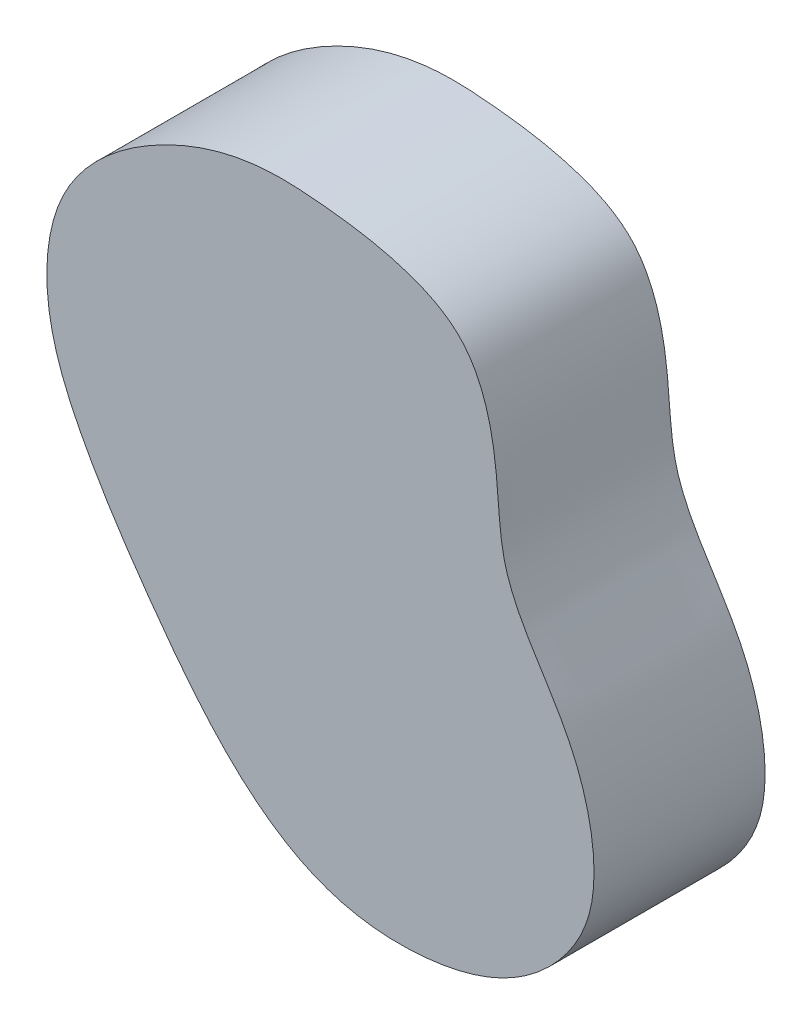
ISO-10303-21;
HEADER;
FILE_DESCRIPTION(('STEP AP214'),'2;1');
FILE_NAME('part.step','',(''),(''),'','','');
FILE_SCHEMA(('AUTOMOTIVE_DESIGN { 1 0 10303 214 1 1 1 1 }'));
ENDSEC;
DATA;
#1=APPLICATION_CONTEXT('core data for automotive mechanical design processes');
#2=APPLICATION_PROTOCOL_DEFINITION('international standard','automotive_design',2000,#1);
#3=PRODUCT_CONTEXT('',#1,'mechanical');
#4=PRODUCT('Part','Part','',(#3));
#5=PRODUCT_RELATED_PRODUCT_CATEGORY('part','',(#4));
#6=PRODUCT_DEFINITION_FORMATION('','',#4);
#7=PRODUCT_DEFINITION_CONTEXT('part definition',#1,'design');
#8=PRODUCT_DEFINITION('design','',#6,#7);
#9=PRODUCT_DEFINITION_SHAPE('','',#8);
#10=(LENGTH_UNIT() NAMED_UNIT(*) SI_UNIT(.MILLI.,.METRE.));
#11=(NAMED_UNIT(*) PLANE_ANGLE_UNIT() SI_UNIT($,.RADIAN.));
#12=(NAMED_UNIT(*) SI_UNIT($,.STERADIAN.) SOLID_ANGLE_UNIT());
#13=UNCERTAINTY_MEASURE_WITH_UNIT(LENGTH_MEASURE(1.E-05),#10,'distance_accuracy_value','');
#14=(GEOMETRIC_REPRESENTATION_CONTEXT(3) GLOBAL_UNCERTAINTY_ASSIGNED_CONTEXT((#13)) GLOBAL_UNIT_ASSIGNED_CONTEXT((#10,
#11,#12)) REPRESENTATION_CONTEXT('',''));
#15=CARTESIAN_POINT('',(0.,0.,0.));
#16=DIRECTION('',(0.,0.,1.));
#17=DIRECTION('',(1.,0.,0.));
#18=AXIS2_PLACEMENT_3D('',#15,#16,#17);
#19=CARTESIAN_POINT('',(14.4126326379732,82.6880855721991,20.));
#20=CARTESIAN_POINT('',(10.6924577953716,82.2592166150717,20.));
#21=CARTESIAN_POINT('',(1.96312079757312,79.3683401060966,20.));
#22=CARTESIAN_POINT('',(-9.52157975276191,69.9092963397695,20.));
#23=CARTESIAN_POINT('',(-10.4578346053765,55.1229649615053,20.));
#24=CARTESIAN_POINT('',(-4.9800979632938,43.1044614897824,20.));
#25=CARTESIAN_POINT('',(4.44052595957275,29.0683164028426,20.));
#26=CARTESIAN_POINT('',(15.2707087192553,15.5891077944176,20.));
#27=CARTESIAN_POINT('',(28.4088765900426,11.880027270964,20.));
#28=CARTESIAN_POINT('',(38.5895722133695,12.6333866001666,20.));
#29=CARTESIAN_POINT('',(46.0866654595498,15.7087995465948,20.));
#30=CARTESIAN_POINT('',(51.7784098430687,21.3982251765188,20.));
#31=CARTESIAN_POINT('',(54.9721169208293,28.9381908057641,20.));
#32=CARTESIAN_POINT('',(53.5436319034221,38.3089526863735,20.));
#33=CARTESIAN_POINT('',(49.0194772536659,47.2735865094687,20.));
#34=CARTESIAN_POINT('',(43.6309374753525,54.3263494690807,20.));
#35=CARTESIAN_POINT('',(42.9991221089784,62.8532970875436,20.));
#36=CARTESIAN_POINT('',(42.4288308179862,69.7981029019992,20.));
#37=CARTESIAN_POINT('',(39.6688404134209,77.775110921927,20.));
#38=CARTESIAN_POINT('',(31.0868475569375,81.5148649121314,20.));
#39=CARTESIAN_POINT('',(23.7014673725308,82.5592564219861,20.));
#40=CARTESIAN_POINT('',(18.0808263266894,82.964112433824,20.));
#41=CARTESIAN_POINT('',(15.399751794857,82.8018825794057,20.));
#42=CARTESIAN_POINT('',(14.4126326379732,82.6880855721991,20.));
#43=B_SPLINE_CURVE_WITH_KNOTS('',3,(#19,#20,#21,#22,#23,#24,#25,#26,#27,#28,#29,#30,#31,#32,#33,
#34,#35,#36,#37,#38,#39,#40,#41,#42),.UNSPECIFIED.,.T.,.F.,(4,1,1,1,1,1,1,1,1,1,1,1,1,1,1,1,1,1,
1,1,1,4),(-0.0812606182357557,-0.0135084358020006,0.0834787864281551,0.165992128571342,
0.232520926699895,0.320059602922377,0.472532666263733,0.538005046795927,0.583308401276811,
0.635794054225316,0.683072128049939,0.727262826605621,0.797571620611477,0.836187723280258,
0.913693120503331,0.949936213683998,0.987074486573451,1.04189510647415,1.090371031496,
1.14550501588137,1.17590666580854,1.19388417493934),.UNSPECIFIED.);
#44=DIRECTION('',(0.,0.,-1.));
#45=VECTOR('',#44,1.);
#46=SURFACE_OF_LINEAR_EXTRUSION('',#43,#45);
#47=CARTESIAN_POINT('',(14.4126326379732,82.6880855721991,20.));
#48=VERTEX_POINT('',#47);
#49=EDGE_CURVE('E10',#48,#48,#43,.T.);
#50=ORIENTED_EDGE('',*,*,#49,.F.);
#51=EDGE_LOOP('',(#50));
#52=FACE_BOUND('',#51,.T.);
#53=CARTESIAN_POINT('',(14.4126326379732,82.6880855721991,0.));
#54=CARTESIAN_POINT('',(10.6924577953716,82.2592166150717,0.));
#55=CARTESIAN_POINT('',(1.96312079757312,79.3683401060966,0.));
#56=CARTESIAN_POINT('',(-9.52157975276191,69.9092963397695,0.));
#57=CARTESIAN_POINT('',(-10.4578346053765,55.1229649615053,0.));
#58=CARTESIAN_POINT('',(-4.9800979632938,43.1044614897824,0.));
#59=CARTESIAN_POINT('',(4.44052595957275,29.0683164028426,0.));
#60=CARTESIAN_POINT('',(15.2707087192553,15.5891077944176,0.));
#61=CARTESIAN_POINT('',(28.4088765900426,11.880027270964,0.));
#62=CARTESIAN_POINT('',(38.5895722133695,12.6333866001666,0.));
#63=CARTESIAN_POINT('',(46.0866654595498,15.7087995465948,0.));
#64=CARTESIAN_POINT('',(51.7784098430687,21.3982251765188,0.));
#65=CARTESIAN_POINT('',(54.9721169208293,28.9381908057641,0.));
#66=CARTESIAN_POINT('',(53.5436319034221,38.3089526863735,0.));
#67=CARTESIAN_POINT('',(49.0194772536659,47.2735865094687,0.));
#68=CARTESIAN_POINT('',(43.6309374753525,54.3263494690807,0.));
#69=CARTESIAN_POINT('',(42.9991221089784,62.8532970875436,0.));
#70=CARTESIAN_POINT('',(42.4288308179862,69.7981029019992,0.));
#71=CARTESIAN_POINT('',(39.6688404134209,77.775110921927,0.));
#72=CARTESIAN_POINT('',(31.0868475569375,81.5148649121314,0.));
#73=CARTESIAN_POINT('',(23.7014673725308,82.5592564219861,0.));
#74=CARTESIAN_POINT('',(18.0808263266894,82.964112433824,0.));
#75=CARTESIAN_POINT('',(15.399751794857,82.8018825794057,0.));
#76=CARTESIAN_POINT('',(14.4126326379732,82.6880855721991,0.));
#77=B_SPLINE_CURVE_WITH_KNOTS('',3,(#53,#54,#55,#56,#57,#58,#59,#60,#61,#62,#63,#64,#65,#66,#67,
#68,#69,#70,#71,#72,#73,#74,#75,#76),.UNSPECIFIED.,.T.,.F.,(4,1,1,1,1,1,1,1,1,1,1,1,1,1,1,1,1,1,
1,1,1,4),(-0.0812606182357557,-0.0135084358020006,0.0834787864281551,0.165992128571342,
0.232520926699895,0.320059602922377,0.472532666263733,0.538005046795927,0.583308401276811,
0.635794054225316,0.683072128049939,0.727262826605621,0.797571620611477,0.836187723280258,
0.913693120503331,0.949936213683998,0.987074486573451,1.04189510647415,1.090371031496,
1.14550501588137,1.17590666580854,1.19388417493934),.UNSPECIFIED.);
#78=CARTESIAN_POINT('',(14.4126326379732,82.6880855721991,0.));
#79=VERTEX_POINT('',#78);
#80=EDGE_CURVE('E37',#79,#79,#77,.T.);
#81=ORIENTED_EDGE('',*,*,#80,.T.);
#82=EDGE_LOOP('',(#81));
#83=FACE_BOUND('',#82,.T.);
#84=ADVANCED_FACE('F33',(#52,#83),#46,.F.);
#85=CARTESIAN_POINT('',(33.1253350393615,12.3228219750547,20.));
#86=DIRECTION('',(0.,0.,-1.));
#87=DIRECTION('',(-1.,0.,0.));
#88=AXIS2_PLACEMENT_3D('',#85,#86,#87);
#89=PLANE('',#88);
#90=ORIENTED_EDGE('',*,*,#49,.T.);
#91=EDGE_LOOP('',(#90));
#92=FACE_BOUND('',#91,.T.);
#93=ADVANCED_FACE('F56',(#92),#89,.F.);
#94=CARTESIAN_POINT('',(33.1253350393615,12.3228219750547,0.));
#95=DIRECTION('',(0.,0.,-1.));
#96=DIRECTION('',(-1.,0.,0.));
#97=AXIS2_PLACEMENT_3D('',#94,#95,#96);
#98=PLANE('',#97);
#99=ORIENTED_EDGE('',*,*,#80,.F.);
#100=EDGE_LOOP('',(#99));
#101=FACE_BOUND('',#100,.T.);
#102=ADVANCED_FACE('F54',(#101),#98,.T.);
#103=CLOSED_SHELL('',(#84,#93,#102));
#104=MANIFOLD_SOLID_BREP('B2',#103);
#105=ADVANCED_BREP_SHAPE_REPRESENTATION('',(#18,#104),#14);
#106=SHAPE_DEFINITION_REPRESENTATION(#9,#105);
ENDSEC;
END-ISO-10303-21;
